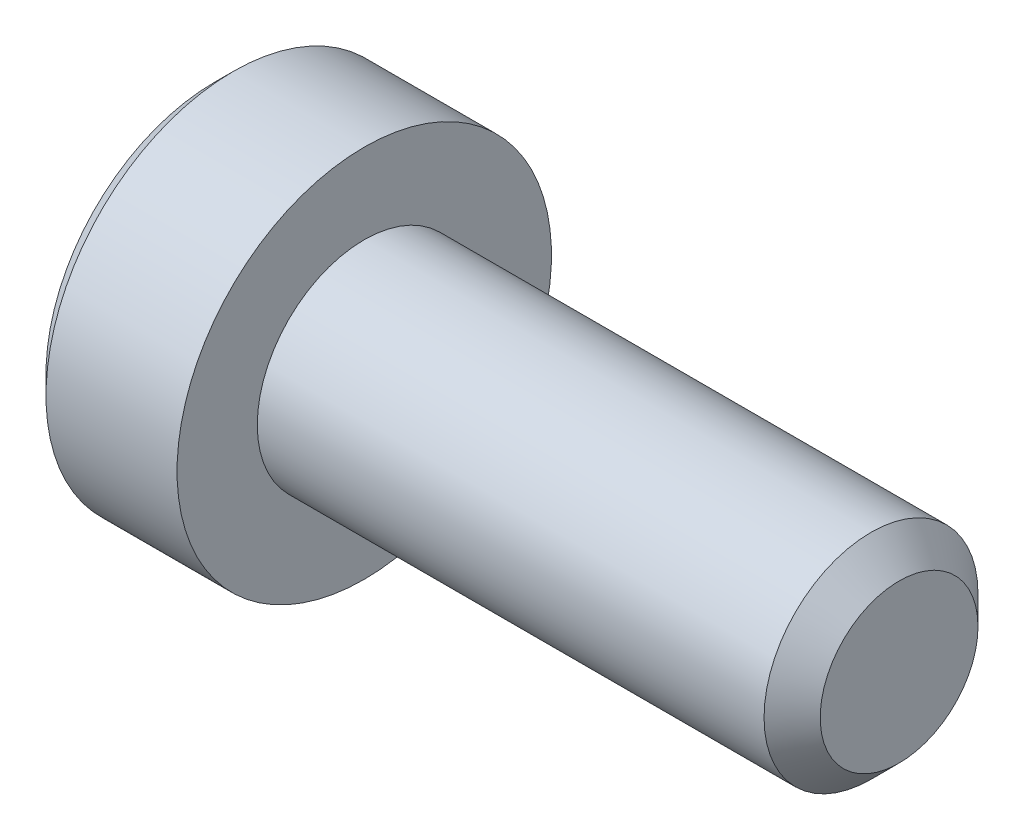
ISO-10303-21;
HEADER;
FILE_DESCRIPTION(('STEP AP214'),'2;1');
FILE_NAME('part.step','',(''),(''),'','','');
FILE_SCHEMA(('AUTOMOTIVE_DESIGN { 1 0 10303 214 1 1 1 1 }'));
ENDSEC;
DATA;
#1=APPLICATION_CONTEXT('core data for automotive mechanical design processes');
#2=APPLICATION_PROTOCOL_DEFINITION('international standard','automotive_design',2000,#1);
#3=PRODUCT_CONTEXT('',#1,'mechanical');
#4=PRODUCT('Part','Part','',(#3));
#5=PRODUCT_RELATED_PRODUCT_CATEGORY('part','',(#4));
#6=PRODUCT_DEFINITION_FORMATION('','',#4);
#7=PRODUCT_DEFINITION_CONTEXT('part definition',#1,'design');
#8=PRODUCT_DEFINITION('design','',#6,#7);
#9=PRODUCT_DEFINITION_SHAPE('','',#8);
#10=(LENGTH_UNIT() NAMED_UNIT(*) SI_UNIT(.MILLI.,.METRE.));
#11=(NAMED_UNIT(*) PLANE_ANGLE_UNIT() SI_UNIT($,.RADIAN.));
#12=(NAMED_UNIT(*) SI_UNIT($,.STERADIAN.) SOLID_ANGLE_UNIT());
#13=UNCERTAINTY_MEASURE_WITH_UNIT(LENGTH_MEASURE(1.E-05),#10,'distance_accuracy_value','');
#14=(GEOMETRIC_REPRESENTATION_CONTEXT(3) GLOBAL_UNCERTAINTY_ASSIGNED_CONTEXT((#13)) GLOBAL_UNIT_ASSIGNED_CONTEXT((#10,
#11,#12)) REPRESENTATION_CONTEXT('',''));
#15=CARTESIAN_POINT('',(0.,0.,0.));
#16=DIRECTION('',(0.,0.,1.));
#17=DIRECTION('',(1.,0.,0.));
#18=AXIS2_PLACEMENT_3D('',#15,#16,#17);
#19=CARTESIAN_POINT('',(-7.8,3.15,0.));
#20=DIRECTION('',(-1.,0.,0.));
#21=DIRECTION('',(0.,-1.,0.));
#22=AXIS2_PLACEMENT_3D('',#19,#20,#21);
#23=PLANE('',#22);
#24=CARTESIAN_POINT('',(-7.8,0.,0.));
#25=DIRECTION('',(-1.,0.,0.));
#26=DIRECTION('',(0.,-1.,0.));
#27=AXIS2_PLACEMENT_3D('',#24,#25,#26);
#28=CIRCLE('',#27,1.44337567297401);
#29=CARTESIAN_POINT('',(-7.80000000000001,-1.44337567297399,-1.36609473733174E-13));
#30=VERTEX_POINT('',#29);
#31=CARTESIAN_POINT('',(-7.80000000000001,-0.721687836487097,1.24999999999989));
#32=VERTEX_POINT('',#31);
#33=EDGE_CURVE('E132',#30,#32,#28,.T.);
#34=ORIENTED_EDGE('',*,*,#33,.F.);
#35=CARTESIAN_POINT('',(-7.8,-0.721687836487033,-1.25));
#36=VERTEX_POINT('',#35);
#37=EDGE_CURVE('E131',#36,#30,#28,.T.);
#38=ORIENTED_EDGE('',*,*,#37,.F.);
#39=CARTESIAN_POINT('',(-7.8,0.721687836486964,-1.25));
#40=VERTEX_POINT('',#39);
#41=EDGE_CURVE('E101',#40,#36,#28,.T.);
#42=ORIENTED_EDGE('',*,*,#41,.F.);
#43=CARTESIAN_POINT('',(-7.8,1.44337567297404,0.));
#44=VERTEX_POINT('',#43);
#45=EDGE_CURVE('E94',#44,#40,#28,.T.);
#46=ORIENTED_EDGE('',*,*,#45,.F.);
#47=CARTESIAN_POINT('',(-7.8,0.721687836486963,1.25));
#48=VERTEX_POINT('',#47);
#49=EDGE_CURVE('E55',#48,#44,#28,.T.);
#50=ORIENTED_EDGE('',*,*,#49,.F.);
#51=EDGE_CURVE('E62',#32,#48,#28,.T.);
#52=ORIENTED_EDGE('',*,*,#51,.F.);
#53=EDGE_LOOP('',(#34,#38,#42,#46,#50,#52));
#54=FACE_BOUND('',#53,.T.);
#55=CARTESIAN_POINT('',(-7.80000000000001,0.,0.));
#56=DIRECTION('',(1.,0.,0.));
#57=DIRECTION('',(0.,1.,0.));
#58=AXIS2_PLACEMENT_3D('',#55,#56,#57);
#59=CIRCLE('',#58,3.15);
#60=CARTESIAN_POINT('',(-7.8,3.15,0.));
#61=VERTEX_POINT('',#60);
#62=EDGE_CURVE('E221',#61,#61,#59,.T.);
#63=ORIENTED_EDGE('',*,*,#62,.F.);
#64=EDGE_LOOP('',(#63));
#65=FACE_BOUND('',#64,.T.);
#66=ADVANCED_FACE('F35',(#54,#65),#23,.T.);
#67=CARTESIAN_POINT('',(-5.,0.,0.));
#68=DIRECTION('',(1.,0.,0.));
#69=DIRECTION('',(0.,0.,-1.));
#70=AXIS2_PLACEMENT_3D('',#67,#68,#69);
#71=CYLINDRICAL_SURFACE('',#70,2.);
#72=CARTESIAN_POINT('',(4.475,0.,0.));
#73=DIRECTION('',(1.,0.,0.));
#74=DIRECTION('',(0.,0.,-1.));
#75=AXIS2_PLACEMENT_3D('',#72,#73,#74);
#76=CIRCLE('',#75,2.);
#77=CARTESIAN_POINT('',(4.475,0.,-2.));
#78=VERTEX_POINT('',#77);
#79=EDGE_CURVE('E49',#78,#78,#76,.F.);
#80=ORIENTED_EDGE('',*,*,#79,.T.);
#81=EDGE_LOOP('',(#80));
#82=FACE_BOUND('',#81,.T.);
#83=CARTESIAN_POINT('',(-5.,0.,0.));
#84=DIRECTION('',(1.,0.,0.));
#85=DIRECTION('',(0.,1.,0.));
#86=AXIS2_PLACEMENT_3D('',#83,#84,#85);
#87=CIRCLE('',#86,2.);
#88=CARTESIAN_POINT('',(-5.,1.99999999999999,0.));
#89=VERTEX_POINT('',#88);
#90=EDGE_CURVE('E214',#89,#89,#87,.F.);
#91=ORIENTED_EDGE('',*,*,#90,.F.);
#92=EDGE_LOOP('',(#91));
#93=FACE_BOUND('',#92,.T.);
#94=ADVANCED_FACE('F194',(#82,#93),#71,.T.);
#95=CARTESIAN_POINT('',(5.,0.,0.));
#96=DIRECTION('',(1.,0.,0.));
#97=DIRECTION('',(0.,0.,-1.));
#98=AXIS2_PLACEMENT_3D('',#95,#96,#97);
#99=PLANE('',#98);
#100=CARTESIAN_POINT('',(5.,0.,0.));
#101=DIRECTION('',(1.,0.,0.));
#102=DIRECTION('',(0.,0.,-1.));
#103=AXIS2_PLACEMENT_3D('',#100,#101,#102);
#104=CIRCLE('',#103,1.475);
#105=CARTESIAN_POINT('',(5.,0.,-1.475));
#106=VERTEX_POINT('',#105);
#107=EDGE_CURVE('E215',#106,#106,#104,.T.);
#108=ORIENTED_EDGE('',*,*,#107,.T.);
#109=EDGE_LOOP('',(#108));
#110=FACE_BOUND('',#109,.T.);
#111=ADVANCED_FACE('F202',(#110),#99,.T.);
#112=CARTESIAN_POINT('',(5.,0.,0.));
#113=DIRECTION('',(-1.,0.,0.));
#114=DIRECTION('',(0.,0.,1.));
#115=AXIS2_PLACEMENT_3D('',#112,#113,#114);
#116=CONICAL_SURFACE('',#115,1.475,0.785398163397447);
#117=ORIENTED_EDGE('',*,*,#79,.F.);
#118=EDGE_LOOP('',(#117));
#119=FACE_BOUND('',#118,.T.);
#120=ORIENTED_EDGE('',*,*,#107,.F.);
#121=EDGE_LOOP('',(#120));
#122=FACE_BOUND('',#121,.T.);
#123=ADVANCED_FACE('F37',(#119,#122),#116,.T.);
#124=CARTESIAN_POINT('',(-5.,0.,0.));
#125=DIRECTION('',(1.,0.,0.));
#126=DIRECTION('',(0.,1.,0.));
#127=AXIS2_PLACEMENT_3D('',#124,#125,#126);
#128=CYLINDRICAL_SURFACE('',#127,3.5);
#129=CARTESIAN_POINT('',(-7.45000000000001,0.,0.));
#130=DIRECTION('',(1.,0.,0.));
#131=DIRECTION('',(0.,1.,0.));
#132=AXIS2_PLACEMENT_3D('',#129,#130,#131);
#133=CIRCLE('',#132,3.5);
#134=CARTESIAN_POINT('',(-7.45,3.5,0.));
#135=VERTEX_POINT('',#134);
#136=EDGE_CURVE('E216',#135,#135,#133,.T.);
#137=ORIENTED_EDGE('',*,*,#136,.T.);
#138=EDGE_LOOP('',(#137));
#139=FACE_BOUND('',#138,.T.);
#140=CARTESIAN_POINT('',(-5.00000000000001,0.,0.));
#141=DIRECTION('',(1.,0.,0.));
#142=DIRECTION('',(0.,1.,0.));
#143=AXIS2_PLACEMENT_3D('',#140,#141,#142);
#144=CIRCLE('',#143,3.5);
#145=CARTESIAN_POINT('',(-5.,3.5,0.));
#146=VERTEX_POINT('',#145);
#147=EDGE_CURVE('E226',#146,#146,#144,.T.);
#148=ORIENTED_EDGE('',*,*,#147,.F.);
#149=EDGE_LOOP('',(#148));
#150=FACE_BOUND('',#149,.T.);
#151=ADVANCED_FACE('F197',(#139,#150),#128,.T.);
#152=CARTESIAN_POINT('',(-7.45000000000001,0.,0.));
#153=DIRECTION('',(1.,0.,0.));
#154=DIRECTION('',(0.,1.,0.));
#155=AXIS2_PLACEMENT_3D('',#152,#153,#154);
#156=CONICAL_SURFACE('',#155,3.5,0.78539816339745);
#157=ORIENTED_EDGE('',*,*,#62,.T.);
#158=EDGE_LOOP('',(#157));
#159=FACE_BOUND('',#158,.T.);
#160=ORIENTED_EDGE('',*,*,#136,.F.);
#161=EDGE_LOOP('',(#160));
#162=FACE_BOUND('',#161,.T.);
#163=ADVANCED_FACE('F190',(#159,#162),#156,.T.);
#164=CARTESIAN_POINT('',(-5.,3.5,0.));
#165=DIRECTION('',(1.,0.,0.));
#166=DIRECTION('',(0.,1.,0.));
#167=AXIS2_PLACEMENT_3D('',#164,#165,#166);
#168=PLANE('',#167);
#169=ORIENTED_EDGE('',*,*,#90,.T.);
#170=EDGE_LOOP('',(#169));
#171=FACE_BOUND('',#170,.T.);
#172=ORIENTED_EDGE('',*,*,#147,.T.);
#173=EDGE_LOOP('',(#172));
#174=FACE_BOUND('',#173,.T.);
#175=ADVANCED_FACE('F154',(#171,#174),#168,.T.);
#176=CARTESIAN_POINT('',(-7.8,0.,0.));
#177=DIRECTION('',(-1.,0.,0.));
#178=DIRECTION('',(0.,-1.,0.));
#179=AXIS2_PLACEMENT_3D('',#176,#177,#178);
#180=CONICAL_SURFACE('',#179,1.44337567297401,0.78539816339745);
#181=CARTESIAN_POINT('',(-8.26298209705051,-1.43934010829017,-1.25));
#182=CARTESIAN_POINT('',(-8.23652492278498,-1.40429313026011,-1.25));
#183=CARTESIAN_POINT('',(-8.21032716050029,-1.36905087155362,-1.25));
#184=CARTESIAN_POINT('',(-8.15855757197347,-1.29809650724889,-1.25));
#185=CARTESIAN_POINT('',(-8.13298590448413,-1.26238428594478,-1.25));
#186=CARTESIAN_POINT('',(-8.05700599379905,-1.15390111808869,-1.25));
#187=CARTESIAN_POINT('',(-8.00774028628704,-1.08031646741186,-1.25));
#188=CARTESIAN_POINT('',(-7.91102583033568,-0.926012322877286,-1.25));
#189=CARTESIAN_POINT('',(-7.86384129900163,-0.845125318763631,-1.25));
#190=CARTESIAN_POINT('',(-7.77753073442667,-0.679311174153425,-1.25));
#191=CARTESIAN_POINT('',(-7.73837753465229,-0.594398891087564,-1.25));
#192=CARTESIAN_POINT('',(-7.69047722370561,-0.466944812509618,-1.25));
#193=CARTESIAN_POINT('',(-7.67672948980397,-0.426289985866723,-1.25));
#194=CARTESIAN_POINT('',(-7.65249792746779,-0.343998850155381,-1.25));
#195=CARTESIAN_POINT('',(-7.64201432388631,-0.302362473684264,-1.25));
#196=CARTESIAN_POINT('',(-7.62503016176226,-0.219052696365172,-1.25));
#197=CARTESIAN_POINT('',(-7.61846136048348,-0.177393428559021,-1.25));
#198=CARTESIAN_POINT('',(-7.60943505346504,-0.0936293694345742,-1.25));
#199=CARTESIAN_POINT('',(-7.60697684100157,-0.0515246559536247,-1.25));
#200=CARTESIAN_POINT('',(-7.60635406201078,0.0311890575224634,-1.25));
#201=CARTESIAN_POINT('',(-7.60803711683997,0.0717969624376569,-1.25));
#202=CARTESIAN_POINT('',(-7.61526827058351,0.152668636765118,-1.25));
#203=CARTESIAN_POINT('',(-7.62081711039435,0.192932338711579,-1.25));
#204=CARTESIAN_POINT('',(-7.63557103643706,0.273499879034215,-1.25));
#205=CARTESIAN_POINT('',(-7.64483817593141,0.31379218048384,-1.25));
#206=CARTESIAN_POINT('',(-7.66653617841494,0.393496413769952,-1.25));
#207=CARTESIAN_POINT('',(-7.67896677668333,0.43290841897031,-1.25));
#208=CARTESIAN_POINT('',(-7.72277935286099,0.556992735686025,-1.25));
#209=CARTESIAN_POINT('',(-7.75915107278422,0.639898924463112,-1.25));
#210=CARTESIAN_POINT('',(-7.84001916204169,0.801816555245376,-1.25));
#211=CARTESIAN_POINT('',(-7.88454472075169,0.880812666046081,-1.25));
#212=CARTESIAN_POINT('',(-7.97640487646106,1.03178561247424,-1.25));
#213=CARTESIAN_POINT('',(-8.02348993368928,1.10391618450778,-1.25));
#214=CARTESIAN_POINT('',(-8.09627856133957,1.21018606006073,-1.25));
#215=CARTESIAN_POINT('',(-8.12079808512381,1.24515069931179,-1.25));
#216=CARTESIAN_POINT('',(-8.17048563647498,1.31460220812617,-1.25));
#217=CARTESIAN_POINT('',(-8.19565348511425,1.34908920555542,-1.25));
#218=CARTESIAN_POINT('',(-8.22109014852938,1.38337731640881,-1.25));
#219=B_SPLINE_CURVE_WITH_KNOTS('',3,(#181,#182,#183,#184,#185,#186,#187,#188,#189,#190,#191,
#192,#193,#194,#195,#196,#197,#198,#199,#200,#201,#202,#203,#204,#205,#206,#207,#208,#209,#210,
#211,#212,#213,#214,#215,#216,#217,#218),.UNSPECIFIED.,.F.,.F.,(4,2,2,2,2,2,2,2,2,2,2,2,2,2,2,2,
2,2,4),(0.,0.131732960406524,0.263498984211803,0.529042014557087,0.809741926293188,
1.08947609738759,1.21811634292657,1.34676544802531,1.47310084535083,1.59941451989633,
1.72115042182426,1.84290966145036,1.96679153917271,2.09066305376597,2.3614669289671,
2.63325989189269,2.89154668194567,3.01965734485813,3.14773302219541),.UNSPECIFIED.);
#220=EDGE_CURVE('E11',#36,#40,#219,.T.);
#221=ORIENTED_EDGE('',*,*,#220,.T.);
#222=ORIENTED_EDGE('',*,*,#41,.T.);
#223=EDGE_LOOP('',(#221,#222));
#224=FACE_BOUND('',#223,.T.);
#225=ADVANCED_FACE('F106',(#224),#180,.F.);
#226=CARTESIAN_POINT('',(-7.80011548390922,-1.4434911430279,0.000200000000000236));
#227=CARTESIAN_POINT('',(-7.77532166805519,-1.41867941875065,-0.042775167071587));
#228=CARTESIAN_POINT('',(-7.75198373441877,-1.39345276980743,-0.086469004745949));
#229=CARTESIAN_POINT('',(-7.70925200408462,-1.34201263554194,-0.175565930841945));
#230=CARTESIAN_POINT('',(-7.6898819923605,-1.31579425481276,-0.220977498357067));
#231=CARTESIAN_POINT('',(-7.65670048341356,-1.26292610442246,-0.312547820935265));
#232=CARTESIAN_POINT('',(-7.64280555905274,-1.23628980770471,-0.358683240175891));
#233=CARTESIAN_POINT('',(-7.62139728216072,-1.18243062538508,-0.4519700804076));
#234=CARTESIAN_POINT('',(-7.61386794156687,-1.15520938653761,-0.499118649136388));
#235=CARTESIAN_POINT('',(-7.60707449805078,-1.10829684367466,-0.580373556887262));
#236=CARTESIAN_POINT('',(-7.60606855910443,-1.08866617256957,-0.614374876627951));
#237=CARTESIAN_POINT('',(-7.6077614149114,-1.0494393280061,-0.682317764432489));
#238=CARTESIAN_POINT('',(-7.61046102721562,-1.02984316311599,-0.71625931765567));
#239=CARTESIAN_POINT('',(-7.61940893031646,-0.990839954603492,-0.783814856457513));
#240=CARTESIAN_POINT('',(-7.62566052589979,-0.971433104248763,-0.817428507286789));
#241=CARTESIAN_POINT('',(-7.64137568141398,-0.932943395609897,-0.884094638217828));
#242=CARTESIAN_POINT('',(-7.65084062008754,-0.913860680098292,-0.917146871030311));
#243=CARTESIAN_POINT('',(-7.67893139068767,-0.86498635135456,-1.00179969160028));
#244=CARTESIAN_POINT('',(-7.69967015745228,-0.83550292014907,-1.05286649242965));
#245=CARTESIAN_POINT('',(-7.74638713467155,-0.777690319475906,-1.15300085411326));
#246=CARTESIAN_POINT('',(-7.77234829594684,-0.749357745598416,-1.20207431157827));
#247=CARTESIAN_POINT('',(-7.80011548390921,-0.721572366433195,-1.2502));
#248=B_SPLINE_CURVE_WITH_KNOTS('',3,(#226,#227,#228,#229,#230,#231,#232,#233,#234,#235,#236,
#237,#238,#239,#240,#241,#242,#243,#244,#245,#246,#247),.UNSPECIFIED.,.F.,.F.,(4,2,2,2,2,2,2,2,
2,2,4),(0.,0.166533409618306,0.334037607289768,0.498880396489707,0.663307919240287,
0.780963963458841,0.898645970148469,1.01643764860775,1.13427993171551,1.32148652032142,
1.50809158792573),.UNSPECIFIED.);
#249=EDGE_CURVE('E134',#30,#36,#248,.T.);
#250=ORIENTED_EDGE('',*,*,#249,.T.);
#251=ORIENTED_EDGE('',*,*,#37,.T.);
#252=EDGE_LOOP('',(#250,#251));
#253=FACE_BOUND('',#252,.T.);
#254=ADVANCED_FACE('F153',(#253),#180,.F.);
#255=CARTESIAN_POINT('',(-7.80011548390921,-0.721572366433195,1.2502));
#256=CARTESIAN_POINT('',(-7.77532166805517,-0.746384090710444,1.20722483292841));
#257=CARTESIAN_POINT('',(-7.75198373441875,-0.771610739653664,1.16353099525405));
#258=CARTESIAN_POINT('',(-7.70925200408461,-0.823050873919153,1.07443406915806));
#259=CARTESIAN_POINT('',(-7.68988199236049,-0.849269254648332,1.02902250164294));
#260=CARTESIAN_POINT('',(-7.65670048341355,-0.902137405038633,0.937452179064745));
#261=CARTESIAN_POINT('',(-7.64280555905273,-0.928773701756384,0.89131675982412));
#262=CARTESIAN_POINT('',(-7.62139728216072,-0.982632884076008,0.798029919592415));
#263=CARTESIAN_POINT('',(-7.61386794156687,-1.00985412292348,0.750881350863629));
#264=CARTESIAN_POINT('',(-7.60707449805078,-1.05676666578642,0.669626443112757));
#265=CARTESIAN_POINT('',(-7.60606855910443,-1.07639733689151,0.635625123372068));
#266=CARTESIAN_POINT('',(-7.6077614149114,-1.11562418145498,0.56768223556753));
#267=CARTESIAN_POINT('',(-7.61046102721562,-1.1352203463451,0.53374068234435));
#268=CARTESIAN_POINT('',(-7.61940893031646,-1.17422355485759,0.466185143542507));
#269=CARTESIAN_POINT('',(-7.62566052589979,-1.19363040521232,0.432571492713231));
#270=CARTESIAN_POINT('',(-7.64137568141399,-1.23212011385119,0.365905361782192));
#271=CARTESIAN_POINT('',(-7.65084062008754,-1.25120282936279,0.332853128969709));
#272=CARTESIAN_POINT('',(-7.67893139068767,-1.30007715810653,0.248200308399739));
#273=CARTESIAN_POINT('',(-7.69967015745228,-1.32956058931202,0.197133507570365));
#274=CARTESIAN_POINT('',(-7.74638713467156,-1.38737318998519,0.0969991458867466));
#275=CARTESIAN_POINT('',(-7.77234829594685,-1.41570576386268,0.0479256884217314));
#276=CARTESIAN_POINT('',(-7.80011548390922,-1.4434911430279,-0.000199999999999691));
#277=B_SPLINE_CURVE_WITH_KNOTS('',3,(#255,#256,#257,#258,#259,#260,#261,#262,#263,#264,#265,
#266,#267,#268,#269,#270,#271,#272,#273,#274,#275,#276),.UNSPECIFIED.,.F.,.F.,(4,2,2,2,2,2,2,2,
2,2,4),(0.,0.1665334096183,0.334037607289754,0.498880396489687,0.66330791924026,
0.780963963458814,0.898645970148441,1.01643764860772,1.13427993171549,1.3214865203214,
1.50809158792573),.UNSPECIFIED.);
#278=EDGE_CURVE('E141',#32,#30,#277,.T.);
#279=ORIENTED_EDGE('',*,*,#278,.T.);
#280=ORIENTED_EDGE('',*,*,#33,.T.);
#281=EDGE_LOOP('',(#279,#280));
#282=FACE_BOUND('',#281,.T.);
#283=ADVANCED_FACE('F259',(#282),#180,.F.);
#284=CARTESIAN_POINT('',(-8.2629820968924,-1.43934010808076,1.25));
#285=CARTESIAN_POINT('',(-8.23652492263296,-1.40429313005657,1.25));
#286=CARTESIAN_POINT('',(-8.21032716035435,-1.36905087135598,1.25));
#287=CARTESIAN_POINT('',(-8.15855757183965,-1.29809650706309,1.25));
#288=CARTESIAN_POINT('',(-8.13298590435636,-1.26238428576494,1.25));
#289=CARTESIAN_POINT('',(-8.05700599368953,-1.15390111792706,1.25));
#290=CARTESIAN_POINT('',(-8.00774028618963,-1.08031646726263,1.25));
#291=CARTESIAN_POINT('',(-7.91102583026319,-0.926012322755078,1.25));
#292=CARTESIAN_POINT('',(-7.86384129894186,-0.845125318656128,1.25));
#293=CARTESIAN_POINT('',(-7.77753073439047,-0.679311174076582,1.25));
#294=CARTESIAN_POINT('',(-7.73837753462696,-0.594398891026667,1.25));
#295=CARTESIAN_POINT('',(-7.69047722368835,-0.466944812460719,1.25));
#296=CARTESIAN_POINT('',(-7.67672948978639,-0.4262899858128,1.25));
#297=CARTESIAN_POINT('',(-7.6524979274506,-0.343998850091245,1.25));
#298=CARTESIAN_POINT('',(-7.64201432386983,-0.30236247361494,1.25));
#299=CARTESIAN_POINT('',(-7.62503016174835,-0.219052696285642,1.25));
#300=CARTESIAN_POINT('',(-7.61846136047142,-0.177393428474476,1.25));
#301=CARTESIAN_POINT('',(-7.60943505345781,-0.0936293693401681,1.25));
#302=CARTESIAN_POINT('',(-7.60697684099732,-0.0515246558543716,1.25));
#303=CARTESIAN_POINT('',(-7.60635406201334,0.0311890576306564,1.25));
#304=CARTESIAN_POINT('',(-7.6080371168463,0.0717969625499555,1.25));
#305=CARTESIAN_POINT('',(-7.61526827059796,0.152668636885223,1.25));
#306=CARTESIAN_POINT('',(-7.62081711041316,0.192932338835384,1.25));
#307=CARTESIAN_POINT('',(-7.635571036465,0.273499879165321,1.25));
#308=CARTESIAN_POINT('',(-7.64483817596416,0.313792180618537,1.25));
#309=CARTESIAN_POINT('',(-7.6665361784574,0.393496413911484,1.25));
#310=CARTESIAN_POINT('',(-7.67896677673069,0.432908419115086,1.25));
#311=CARTESIAN_POINT('',(-7.72277935293149,0.556992735862325,1.25));
#312=CARTESIAN_POINT('',(-7.759151072876,0.639898924666113,1.25));
#313=CARTESIAN_POINT('',(-7.84001916217838,0.801816555499728,1.25));
#314=CARTESIAN_POINT('',(-7.88454472091203,0.880812666325071,1.25));
#315=CARTESIAN_POINT('',(-7.97640487666667,1.03178561279753,1.25));
#316=CARTESIAN_POINT('',(-8.0234899339163,1.10391618485088,1.25));
#317=CARTESIAN_POINT('',(-8.09627856159858,1.21018606043313,1.25));
#318=CARTESIAN_POINT('',(-8.1207980853934,1.24515069969382,1.25));
#319=CARTESIAN_POINT('',(-8.17048563676573,1.31460220852739,1.25));
#320=CARTESIAN_POINT('',(-8.19565348541556,1.34908920596621,1.25));
#321=CARTESIAN_POINT('',(-8.22109014884126,1.38337731682914,1.25));
#322=B_SPLINE_CURVE_WITH_KNOTS('',3,(#284,#285,#286,#287,#288,#289,#290,#291,#292,#293,#294,
#295,#296,#297,#298,#299,#300,#301,#302,#303,#304,#305,#306,#307,#308,#309,#310,#311,#312,#313,
#314,#315,#316,#317,#318,#319,#320,#321),.UNSPECIFIED.,.F.,.F.,(4,2,2,2,2,2,2,2,2,2,2,2,2,2,2,2,
2,2,4),(0.,0.13173296038145,0.263498984161648,0.52904201445583,0.809741926134627,
1.08947609717226,1.21811634272578,1.34676544783902,1.47310084517846,1.59941451973786,
1.72115042167851,1.84290966131737,1.96679153905343,2.09066305366041,2.36146692896011,
2.63325989198493,2.89154668212281,3.01965734507714,3.1477330224563),.UNSPECIFIED.);
#323=EDGE_CURVE('E161',#48,#32,#322,.F.);
#324=ORIENTED_EDGE('',*,*,#323,.T.);
#325=ORIENTED_EDGE('',*,*,#51,.T.);
#326=EDGE_LOOP('',(#324,#325));
#327=FACE_BOUND('',#326,.T.);
#328=ADVANCED_FACE('F275',(#327),#180,.F.);
#329=CARTESIAN_POINT('',(-7.80011548390916,1.4434911430279,-0.000200000000000012));
#330=CARTESIAN_POINT('',(-7.77532166805512,1.41867941875065,0.0427751670715856));
#331=CARTESIAN_POINT('',(-7.7519837344187,1.39345276980743,0.0864690047459461));
#332=CARTESIAN_POINT('',(-7.70925200408456,1.34201263554194,0.175565930841939));
#333=CARTESIAN_POINT('',(-7.68988199236044,1.31579425481277,0.22097749835706));
#334=CARTESIAN_POINT('',(-7.6567004834135,1.26292610442246,0.312547820935254));
#335=CARTESIAN_POINT('',(-7.64280555905268,1.23628980770471,0.358683240175879));
#336=CARTESIAN_POINT('',(-7.62139728216066,1.18243062538509,0.451970080407584));
#337=CARTESIAN_POINT('',(-7.61386794156681,1.15520938653762,0.49911864913637));
#338=CARTESIAN_POINT('',(-7.60707449805073,1.10829684367468,0.580373556887241));
#339=CARTESIAN_POINT('',(-7.60606855910437,1.08866617256959,0.614374876627929));
#340=CARTESIAN_POINT('',(-7.60776141491134,1.04943932800612,0.682317764432465));
#341=CARTESIAN_POINT('',(-7.61046102721556,1.029843163116,0.716259317655644));
#342=CARTESIAN_POINT('',(-7.6194089303164,0.990839954603508,0.783814856457485));
#343=CARTESIAN_POINT('',(-7.62566052589973,0.97143310424878,0.81742850728676));
#344=CARTESIAN_POINT('',(-7.64137568141393,0.932943395609915,0.884094638217797));
#345=CARTESIAN_POINT('',(-7.65084062008748,0.91386068009831,0.917146871030279));
#346=CARTESIAN_POINT('',(-7.67893139068761,0.864986351354576,1.00179969160025));
#347=CARTESIAN_POINT('',(-7.69967015745223,0.835502920149083,1.05286649242963));
#348=CARTESIAN_POINT('',(-7.74638713467151,0.777690319475912,1.15300085411325));
#349=CARTESIAN_POINT('',(-7.7723482959468,0.749357745598419,1.20207431157827));
#350=CARTESIAN_POINT('',(-7.80011548390917,0.721572366433195,1.2502));
#351=B_SPLINE_CURVE_WITH_KNOTS('',3,(#329,#330,#331,#332,#333,#334,#335,#336,#337,#338,#339,
#340,#341,#342,#343,#344,#345,#346,#347,#348,#349,#350),.UNSPECIFIED.,.F.,.F.,(4,2,2,2,2,2,2,2,
2,2,4),(0.,0.1665334096183,0.334037607289755,0.498880396489688,0.663307919240262,
0.780963963458812,0.898645970148436,1.01643764860771,1.13427993171547,1.3214865203214,
1.50809158792574),.UNSPECIFIED.);
#352=EDGE_CURVE('E121',#44,#48,#351,.T.);
#353=ORIENTED_EDGE('',*,*,#352,.T.);
#354=ORIENTED_EDGE('',*,*,#49,.T.);
#355=EDGE_LOOP('',(#353,#354));
#356=FACE_BOUND('',#355,.T.);
#357=ADVANCED_FACE('F251',(#356),#180,.F.);
#358=CARTESIAN_POINT('',(-7.80011548390917,0.721572366433195,-1.2502));
#359=CARTESIAN_POINT('',(-7.77532166805514,0.746384090710445,-1.20722483292841));
#360=CARTESIAN_POINT('',(-7.75198373441872,0.771610739653666,-1.16353099525405));
#361=CARTESIAN_POINT('',(-7.70925200408457,0.823050873919157,-1.07443406915805));
#362=CARTESIAN_POINT('',(-7.68988199236044,0.849269254648336,-1.02902250164293));
#363=CARTESIAN_POINT('',(-7.65670048341351,0.902137405038639,-0.937452179064735));
#364=CARTESIAN_POINT('',(-7.64280555905268,0.928773701756391,-0.891316759824108));
#365=CARTESIAN_POINT('',(-7.62139728216066,0.982632884076018,-0.798029919592399));
#366=CARTESIAN_POINT('',(-7.61386794156681,1.00985412292349,-0.750881350863611));
#367=CARTESIAN_POINT('',(-7.60707449805073,1.05676666578643,-0.669626443112738));
#368=CARTESIAN_POINT('',(-7.60606855910437,1.07639733689152,-0.63562512337205));
#369=CARTESIAN_POINT('',(-7.60776141491134,1.11562418145499,-0.567682235567514));
#370=CARTESIAN_POINT('',(-7.61046102721556,1.13522034634511,-0.533740682344335));
#371=CARTESIAN_POINT('',(-7.6194089303164,1.1742235548576,-0.466185143542494));
#372=CARTESIAN_POINT('',(-7.62566052589973,1.19363040521233,-0.432571492713219));
#373=CARTESIAN_POINT('',(-7.64137568141393,1.2321201138512,-0.365905361782182));
#374=CARTESIAN_POINT('',(-7.65084062008748,1.2512028293628,-0.3328531289697));
#375=CARTESIAN_POINT('',(-7.67893139068761,1.30007715810653,-0.248200308399732));
#376=CARTESIAN_POINT('',(-7.69967015745222,1.32956058931202,-0.197133507570359));
#377=CARTESIAN_POINT('',(-7.7463871346715,1.38737318998519,-0.0969991458867434));
#378=CARTESIAN_POINT('',(-7.77234829594679,1.41570576386268,-0.0479256884217295));
#379=CARTESIAN_POINT('',(-7.80011548390916,1.4434911430279,0.000200000000000163));
#380=B_SPLINE_CURVE_WITH_KNOTS('',3,(#358,#359,#360,#361,#362,#363,#364,#365,#366,#367,#368,
#369,#370,#371,#372,#373,#374,#375,#376,#377,#378,#379),.UNSPECIFIED.,.F.,.F.,(4,2,2,2,2,2,2,2,
2,2,4),(0.,0.166533409618307,0.334037607289768,0.498880396489708,0.663307919240287,
0.780963963458838,0.898645970148463,1.01643764860774,1.1342799317155,1.32148652032141,
1.50809158792574),.UNSPECIFIED.);
#381=EDGE_CURVE('E97',#40,#44,#380,.T.);
#382=ORIENTED_EDGE('',*,*,#381,.T.);
#383=ORIENTED_EDGE('',*,*,#45,.T.);
#384=EDGE_LOOP('',(#382,#383));
#385=FACE_BOUND('',#384,.T.);
#386=ADVANCED_FACE('F95',(#385),#180,.F.);
#387=CARTESIAN_POINT('',(-5.38,1.44337567297406,0.));
#388=DIRECTION('',(1.,0.,0.));
#389=DIRECTION('',(0.,0.,-1.));
#390=AXIS2_PLACEMENT_3D('',#387,#388,#389);
#391=PLANE('',#390);
#392=DIRECTION('',(0.,0.5,0.866025403784439));
#393=VECTOR('',#392,1.);
#394=CARTESIAN_POINT('',(-5.38,0.721687836487033,-1.25));
#395=LINE('',#394,#393);
#396=CARTESIAN_POINT('',(-5.38,0.721687836487033,-1.25));
#397=VERTEX_POINT('',#396);
#398=CARTESIAN_POINT('',(-5.38,1.44337567297406,0.));
#399=VERTEX_POINT('',#398);
#400=EDGE_CURVE('E120',#397,#399,#395,.T.);
#401=ORIENTED_EDGE('',*,*,#400,.F.);
#402=DIRECTION('',(0.,1.,0.));
#403=VECTOR('',#402,1.);
#404=CARTESIAN_POINT('',(-5.38,-0.721687836487033,-1.25));
#405=LINE('',#404,#403);
#406=CARTESIAN_POINT('',(-5.38,-0.721687836487033,-1.25));
#407=VERTEX_POINT('',#406);
#408=EDGE_CURVE('E125',#407,#397,#405,.T.);
#409=ORIENTED_EDGE('',*,*,#408,.F.);
#410=DIRECTION('',(0.,0.5,-0.866025403784439));
#411=VECTOR('',#410,1.);
#412=CARTESIAN_POINT('',(-5.38,-1.44337567297406,0.));
#413=LINE('',#412,#411);
#414=CARTESIAN_POINT('',(-5.38,-1.44337567297406,0.));
#415=VERTEX_POINT('',#414);
#416=EDGE_CURVE('E241',#415,#407,#413,.T.);
#417=ORIENTED_EDGE('',*,*,#416,.F.);
#418=DIRECTION('',(0.,-0.5,-0.866025403784438));
#419=VECTOR('',#418,1.);
#420=CARTESIAN_POINT('',(-5.38,-0.721687836487033,1.25));
#421=LINE('',#420,#419);
#422=CARTESIAN_POINT('',(-5.38,-0.721687836487033,1.25));
#423=VERTEX_POINT('',#422);
#424=EDGE_CURVE('E243',#423,#415,#421,.T.);
#425=ORIENTED_EDGE('',*,*,#424,.F.);
#426=DIRECTION('',(0.,-1.,0.));
#427=VECTOR('',#426,1.);
#428=CARTESIAN_POINT('',(-5.38,0.721687836487033,1.25));
#429=LINE('',#428,#427);
#430=CARTESIAN_POINT('',(-5.38,0.721687836487033,1.25));
#431=VERTEX_POINT('',#430);
#432=EDGE_CURVE('E245',#431,#423,#429,.T.);
#433=ORIENTED_EDGE('',*,*,#432,.F.);
#434=DIRECTION('',(0.,-0.5,0.866025403784439));
#435=VECTOR('',#434,1.);
#436=CARTESIAN_POINT('',(-5.38,1.44337567297406,0.));
#437=LINE('',#436,#435);
#438=EDGE_CURVE('E247',#399,#431,#437,.T.);
#439=ORIENTED_EDGE('',*,*,#438,.F.);
#440=EDGE_LOOP('',(#401,#409,#417,#425,#433,#439));
#441=FACE_BOUND('',#440,.T.);
#442=ADVANCED_FACE('F155',(#441),#391,.F.);
#443=CARTESIAN_POINT('',(-5.38,-0.721687836487033,-1.25));
#444=DIRECTION('',(0.,0.,1.));
#445=DIRECTION('',(0.,-1.,0.));
#446=AXIS2_PLACEMENT_3D('',#443,#444,#445);
#447=PLANE('',#446);
#448=ORIENTED_EDGE('',*,*,#220,.F.);
#449=DIRECTION('',(-1.,0.,0.));
#450=VECTOR('',#449,1.);
#451=CARTESIAN_POINT('',(-5.38,-0.721687836487033,-1.25));
#452=LINE('',#451,#450);
#453=EDGE_CURVE('E126',#407,#36,#452,.T.);
#454=ORIENTED_EDGE('',*,*,#453,.F.);
#455=ORIENTED_EDGE('',*,*,#408,.T.);
#456=DIRECTION('',(-1.,0.,0.));
#457=VECTOR('',#456,1.);
#458=CARTESIAN_POINT('',(-5.38,0.721687836487033,-1.25));
#459=LINE('',#458,#457);
#460=EDGE_CURVE('E116',#397,#40,#459,.T.);
#461=ORIENTED_EDGE('',*,*,#460,.T.);
#462=EDGE_LOOP('',(#448,#454,#455,#461));
#463=FACE_BOUND('',#462,.T.);
#464=ADVANCED_FACE('F123',(#463),#447,.T.);
#465=CARTESIAN_POINT('',(-5.38,-1.44337567297406,0.));
#466=DIRECTION('',(0.,0.866025403784439,0.5));
#467=DIRECTION('',(0.,-0.5,0.866025403784439));
#468=AXIS2_PLACEMENT_3D('',#465,#466,#467);
#469=PLANE('',#468);
#470=ORIENTED_EDGE('',*,*,#249,.F.);
#471=DIRECTION('',(-1.,0.,0.));
#472=VECTOR('',#471,1.);
#473=CARTESIAN_POINT('',(-5.38,-1.44337567297406,0.));
#474=LINE('',#473,#472);
#475=EDGE_CURVE('E236',#415,#30,#474,.T.);
#476=ORIENTED_EDGE('',*,*,#475,.F.);
#477=ORIENTED_EDGE('',*,*,#416,.T.);
#478=ORIENTED_EDGE('',*,*,#453,.T.);
#479=EDGE_LOOP('',(#470,#476,#477,#478));
#480=FACE_BOUND('',#479,.T.);
#481=ADVANCED_FACE('F148',(#480),#469,.T.);
#482=CARTESIAN_POINT('',(-5.38,-0.721687836487033,1.25));
#483=DIRECTION('',(0.,0.866025403784438,-0.5));
#484=DIRECTION('',(0.,0.5,0.866025403784439));
#485=AXIS2_PLACEMENT_3D('',#482,#483,#484);
#486=PLANE('',#485);
#487=ORIENTED_EDGE('',*,*,#278,.F.);
#488=DIRECTION('',(-1.,0.,0.));
#489=VECTOR('',#488,1.);
#490=CARTESIAN_POINT('',(-5.38,-0.721687836487033,1.25));
#491=LINE('',#490,#489);
#492=EDGE_CURVE('E233',#423,#32,#491,.T.);
#493=ORIENTED_EDGE('',*,*,#492,.F.);
#494=ORIENTED_EDGE('',*,*,#424,.T.);
#495=ORIENTED_EDGE('',*,*,#475,.T.);
#496=EDGE_LOOP('',(#487,#493,#494,#495));
#497=FACE_BOUND('',#496,.T.);
#498=ADVANCED_FACE('F265',(#497),#486,.T.);
#499=CARTESIAN_POINT('',(-5.38,0.721687836487033,1.25));
#500=DIRECTION('',(0.,0.,-1.));
#501=DIRECTION('',(0.,1.,0.));
#502=AXIS2_PLACEMENT_3D('',#499,#500,#501);
#503=PLANE('',#502);
#504=ORIENTED_EDGE('',*,*,#323,.F.);
#505=DIRECTION('',(-1.,0.,0.));
#506=VECTOR('',#505,1.);
#507=CARTESIAN_POINT('',(-5.38,0.721687836487033,1.25));
#508=LINE('',#507,#506);
#509=EDGE_CURVE('E230',#431,#48,#508,.T.);
#510=ORIENTED_EDGE('',*,*,#509,.F.);
#511=ORIENTED_EDGE('',*,*,#432,.T.);
#512=ORIENTED_EDGE('',*,*,#492,.T.);
#513=EDGE_LOOP('',(#504,#510,#511,#512));
#514=FACE_BOUND('',#513,.T.);
#515=ADVANCED_FACE('F182',(#514),#503,.T.);
#516=CARTESIAN_POINT('',(-5.38,1.44337567297406,0.));
#517=DIRECTION('',(0.,-0.866025403784439,-0.5));
#518=DIRECTION('',(0.,0.5,-0.866025403784439));
#519=AXIS2_PLACEMENT_3D('',#516,#517,#518);
#520=PLANE('',#519);
#521=ORIENTED_EDGE('',*,*,#352,.F.);
#522=DIRECTION('',(-1.,0.,0.));
#523=VECTOR('',#522,1.);
#524=CARTESIAN_POINT('',(-5.38,1.44337567297406,0.));
#525=LINE('',#524,#523);
#526=EDGE_CURVE('E119',#399,#44,#525,.T.);
#527=ORIENTED_EDGE('',*,*,#526,.F.);
#528=ORIENTED_EDGE('',*,*,#438,.T.);
#529=ORIENTED_EDGE('',*,*,#509,.T.);
#530=EDGE_LOOP('',(#521,#527,#528,#529));
#531=FACE_BOUND('',#530,.T.);
#532=ADVANCED_FACE('F179',(#531),#520,.T.);
#533=CARTESIAN_POINT('',(-5.38,0.721687836487033,-1.25));
#534=DIRECTION('',(0.,-0.866025403784439,0.5));
#535=DIRECTION('',(0.,-0.5,-0.866025403784439));
#536=AXIS2_PLACEMENT_3D('',#533,#534,#535);
#537=PLANE('',#536);
#538=ORIENTED_EDGE('',*,*,#381,.F.);
#539=ORIENTED_EDGE('',*,*,#460,.F.);
#540=ORIENTED_EDGE('',*,*,#400,.T.);
#541=ORIENTED_EDGE('',*,*,#526,.T.);
#542=EDGE_LOOP('',(#538,#539,#540,#541));
#543=FACE_BOUND('',#542,.T.);
#544=ADVANCED_FACE('F114',(#543),#537,.T.);
#545=CLOSED_SHELL('',(#66,#94,#111,#123,#151,#163,#175,#225,#254,#283,#328,#357,#386,#442,#464,
#481,#498,#515,#532,#544));
#546=MANIFOLD_SOLID_BREP('B2',#545);
#547=ADVANCED_BREP_SHAPE_REPRESENTATION('',(#18,#546),#14);
#548=SHAPE_DEFINITION_REPRESENTATION(#9,#547);
ENDSEC;
END-ISO-10303-21;
